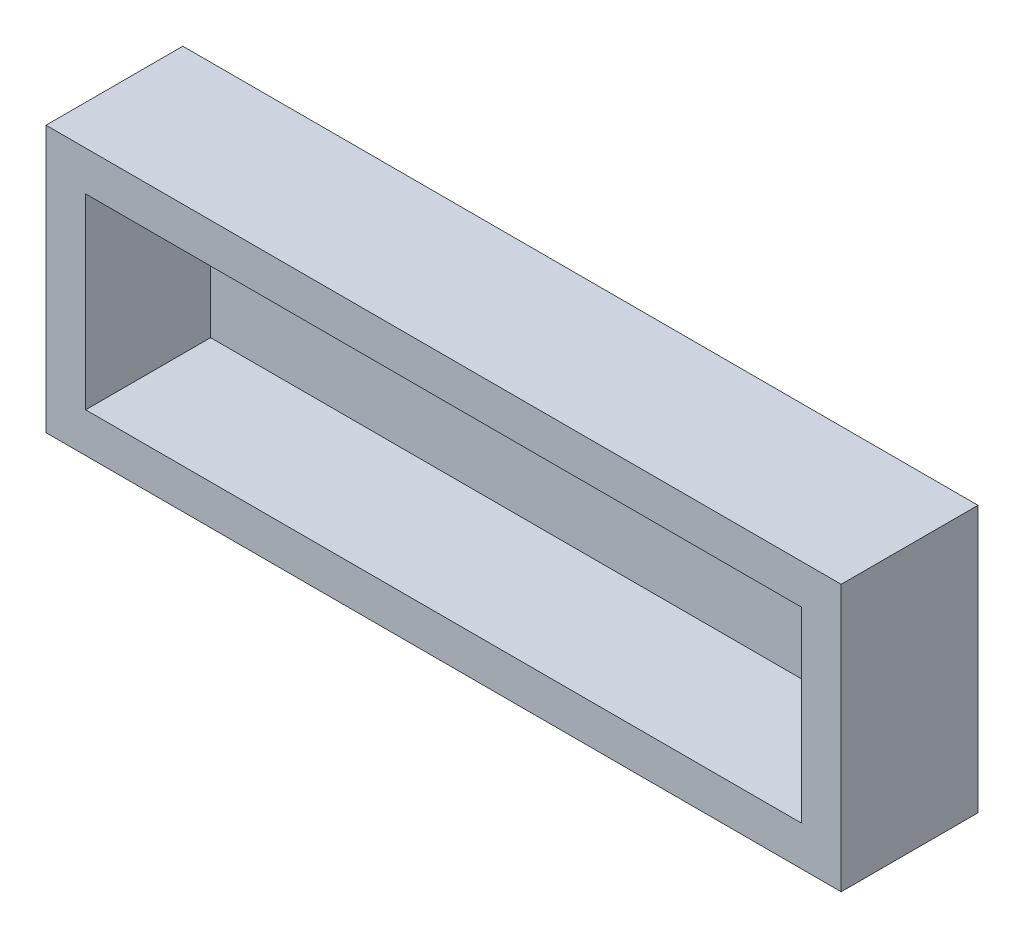
ISO-10303-21;
HEADER;
FILE_DESCRIPTION(('STEP AP214'),'2;1');
FILE_NAME('part.step','',(''),(''),'','','');
FILE_SCHEMA(('AUTOMOTIVE_DESIGN { 1 0 10303 214 1 1 1 1 }'));
ENDSEC;
DATA;
#1=APPLICATION_CONTEXT('core data for automotive mechanical design processes');
#2=APPLICATION_PROTOCOL_DEFINITION('international standard','automotive_design',2000,#1);
#3=PRODUCT_CONTEXT('',#1,'mechanical');
#4=PRODUCT('Part','Part','',(#3));
#5=PRODUCT_RELATED_PRODUCT_CATEGORY('part','',(#4));
#6=PRODUCT_DEFINITION_FORMATION('','',#4);
#7=PRODUCT_DEFINITION_CONTEXT('part definition',#1,'design');
#8=PRODUCT_DEFINITION('design','',#6,#7);
#9=PRODUCT_DEFINITION_SHAPE('','',#8);
#10=(LENGTH_UNIT() NAMED_UNIT(*) SI_UNIT(.MILLI.,.METRE.));
#11=(NAMED_UNIT(*) PLANE_ANGLE_UNIT() SI_UNIT($,.RADIAN.));
#12=(NAMED_UNIT(*) SI_UNIT($,.STERADIAN.) SOLID_ANGLE_UNIT());
#13=UNCERTAINTY_MEASURE_WITH_UNIT(LENGTH_MEASURE(1.E-05),#10,'distance_accuracy_value','');
#14=(GEOMETRIC_REPRESENTATION_CONTEXT(3) GLOBAL_UNCERTAINTY_ASSIGNED_CONTEXT((#13)) GLOBAL_UNIT_ASSIGNED_CONTEXT((#10,
#11,#12)) REPRESENTATION_CONTEXT('',''));
#15=CARTESIAN_POINT('',(0.,0.,0.));
#16=DIRECTION('',(0.,0.,1.));
#17=DIRECTION('',(1.,0.,0.));
#18=AXIS2_PLACEMENT_3D('',#15,#16,#17);
#19=CARTESIAN_POINT('',(-100.251,-33.576,34.5));
#20=DIRECTION('',(1.,0.,0.));
#21=DIRECTION('',(0.,0.,-1.));
#22=AXIS2_PLACEMENT_3D('',#19,#20,#21);
#23=PLANE('',#22);
#24=DIRECTION('',(0.,-1.,0.));
#25=VECTOR('',#24,1.);
#26=CARTESIAN_POINT('',(-100.251,-33.576,0.));
#27=LINE('',#26,#25);
#28=CARTESIAN_POINT('',(-100.251,33.576,0.));
#29=VERTEX_POINT('',#28);
#30=CARTESIAN_POINT('',(-100.251,-33.576,0.));
#31=VERTEX_POINT('',#30);
#32=EDGE_CURVE('E167',#29,#31,#27,.T.);
#33=ORIENTED_EDGE('',*,*,#32,.T.);
#34=DIRECTION('',(0.,0.,-1.));
#35=VECTOR('',#34,1.);
#36=CARTESIAN_POINT('',(-100.251,-33.576,34.5));
#37=LINE('',#36,#35);
#38=CARTESIAN_POINT('',(-100.251,-33.576,34.5));
#39=VERTEX_POINT('',#38);
#40=EDGE_CURVE('E11',#39,#31,#37,.T.);
#41=ORIENTED_EDGE('',*,*,#40,.F.);
#42=DIRECTION('',(0.,-1.,0.));
#43=VECTOR('',#42,1.);
#44=CARTESIAN_POINT('',(-100.251,-33.576,34.5));
#45=LINE('',#44,#43);
#46=CARTESIAN_POINT('',(-100.251,33.576,34.5));
#47=VERTEX_POINT('',#46);
#48=EDGE_CURVE('E156',#47,#39,#45,.T.);
#49=ORIENTED_EDGE('',*,*,#48,.F.);
#50=DIRECTION('',(0.,0.,-1.));
#51=VECTOR('',#50,1.);
#52=CARTESIAN_POINT('',(-100.251,33.576,34.5));
#53=LINE('',#52,#51);
#54=EDGE_CURVE('E166',#47,#29,#53,.T.);
#55=ORIENTED_EDGE('',*,*,#54,.T.);
#56=EDGE_LOOP('',(#33,#41,#49,#55));
#57=FACE_BOUND('',#56,.T.);
#58=ADVANCED_FACE('F39',(#57),#23,.F.);
#59=CARTESIAN_POINT('',(100.251,-33.576,34.5));
#60=DIRECTION('',(0.,1.,0.));
#61=DIRECTION('',(-1.,0.,0.));
#62=AXIS2_PLACEMENT_3D('',#59,#60,#61);
#63=PLANE('',#62);
#64=DIRECTION('',(1.,0.,0.));
#65=VECTOR('',#64,1.);
#66=CARTESIAN_POINT('',(100.251,-33.576,0.));
#67=LINE('',#66,#65);
#68=CARTESIAN_POINT('',(100.251,-33.576,0.));
#69=VERTEX_POINT('',#68);
#70=EDGE_CURVE('E171',#31,#69,#67,.T.);
#71=ORIENTED_EDGE('',*,*,#70,.T.);
#72=DIRECTION('',(0.,0.,-1.));
#73=VECTOR('',#72,1.);
#74=CARTESIAN_POINT('',(100.251,-33.576,34.5));
#75=LINE('',#74,#73);
#76=CARTESIAN_POINT('',(100.251,-33.576,34.5));
#77=VERTEX_POINT('',#76);
#78=EDGE_CURVE('E47',#77,#69,#75,.T.);
#79=ORIENTED_EDGE('',*,*,#78,.F.);
#80=DIRECTION('',(1.,0.,0.));
#81=VECTOR('',#80,1.);
#82=CARTESIAN_POINT('',(100.251,-33.576,34.5));
#83=LINE('',#82,#81);
#84=EDGE_CURVE('E91',#39,#77,#83,.T.);
#85=ORIENTED_EDGE('',*,*,#84,.F.);
#86=ORIENTED_EDGE('',*,*,#40,.T.);
#87=EDGE_LOOP('',(#71,#79,#85,#86));
#88=FACE_BOUND('',#87,.T.);
#89=ADVANCED_FACE('F206',(#88),#63,.F.);
#90=CARTESIAN_POINT('',(100.251,-33.576,34.5));
#91=DIRECTION('',(-1.,0.,0.));
#92=DIRECTION('',(0.,0.,1.));
#93=AXIS2_PLACEMENT_3D('',#90,#91,#92);
#94=PLANE('',#93);
#95=DIRECTION('',(0.,1.,0.));
#96=VECTOR('',#95,1.);
#97=CARTESIAN_POINT('',(100.251,-33.576,0.));
#98=LINE('',#97,#96);
#99=CARTESIAN_POINT('',(100.251,33.576,0.));
#100=VERTEX_POINT('',#99);
#101=EDGE_CURVE('E174',#69,#100,#98,.T.);
#102=ORIENTED_EDGE('',*,*,#101,.T.);
#103=DIRECTION('',(0.,0.,-1.));
#104=VECTOR('',#103,1.);
#105=CARTESIAN_POINT('',(100.251,33.576,34.5));
#106=LINE('',#105,#104);
#107=CARTESIAN_POINT('',(100.251,33.576,34.5));
#108=VERTEX_POINT('',#107);
#109=EDGE_CURVE('E181',#108,#100,#106,.T.);
#110=ORIENTED_EDGE('',*,*,#109,.F.);
#111=DIRECTION('',(0.,1.,0.));
#112=VECTOR('',#111,1.);
#113=CARTESIAN_POINT('',(100.251,-33.576,34.5));
#114=LINE('',#113,#112);
#115=EDGE_CURVE('E161',#77,#108,#114,.T.);
#116=ORIENTED_EDGE('',*,*,#115,.F.);
#117=ORIENTED_EDGE('',*,*,#78,.T.);
#118=EDGE_LOOP('',(#102,#110,#116,#117));
#119=FACE_BOUND('',#118,.T.);
#120=ADVANCED_FACE('F188',(#119),#94,.F.);
#121=CARTESIAN_POINT('',(100.251,33.576,34.5));
#122=DIRECTION('',(0.,-1.,0.));
#123=DIRECTION('',(1.,0.,0.));
#124=AXIS2_PLACEMENT_3D('',#121,#122,#123);
#125=PLANE('',#124);
#126=DIRECTION('',(-1.,0.,0.));
#127=VECTOR('',#126,1.);
#128=CARTESIAN_POINT('',(100.251,33.576,0.));
#129=LINE('',#128,#127);
#130=EDGE_CURVE('E84',#100,#29,#129,.T.);
#131=ORIENTED_EDGE('',*,*,#130,.T.);
#132=ORIENTED_EDGE('',*,*,#54,.F.);
#133=DIRECTION('',(-1.,0.,0.));
#134=VECTOR('',#133,1.);
#135=CARTESIAN_POINT('',(100.251,33.576,34.5));
#136=LINE('',#135,#134);
#137=EDGE_CURVE('E63',#108,#47,#136,.T.);
#138=ORIENTED_EDGE('',*,*,#137,.F.);
#139=ORIENTED_EDGE('',*,*,#109,.T.);
#140=EDGE_LOOP('',(#131,#132,#138,#139));
#141=FACE_BOUND('',#140,.T.);
#142=ADVANCED_FACE('F196',(#141),#125,.F.);
#143=CARTESIAN_POINT('',(0.,0.,34.5));
#144=DIRECTION('',(0.,0.,1.));
#145=DIRECTION('',(1.,0.,0.));
#146=AXIS2_PLACEMENT_3D('',#143,#144,#145);
#147=PLANE('',#146);
#148=DIRECTION('',(0.,-1.,0.));
#149=VECTOR('',#148,1.);
#150=CARTESIAN_POINT('',(-90.251,-33.576,34.5));
#151=LINE('',#150,#149);
#152=CARTESIAN_POINT('',(-90.251,23.576,34.5));
#153=VERTEX_POINT('',#152);
#154=CARTESIAN_POINT('',(-90.251,-23.576,34.5));
#155=VERTEX_POINT('',#154);
#156=EDGE_CURVE('E140',#153,#155,#151,.T.);
#157=ORIENTED_EDGE('',*,*,#156,.F.);
#158=DIRECTION('',(-1.,0.,0.));
#159=VECTOR('',#158,1.);
#160=CARTESIAN_POINT('',(100.251,23.576,34.5));
#161=LINE('',#160,#159);
#162=CARTESIAN_POINT('',(90.251,23.576,34.5));
#163=VERTEX_POINT('',#162);
#164=EDGE_CURVE('E153',#163,#153,#161,.T.);
#165=ORIENTED_EDGE('',*,*,#164,.F.);
#166=DIRECTION('',(0.,1.,0.));
#167=VECTOR('',#166,1.);
#168=CARTESIAN_POINT('',(90.251,-33.576,34.5));
#169=LINE('',#168,#167);
#170=CARTESIAN_POINT('',(90.251,-23.576,34.5));
#171=VERTEX_POINT('',#170);
#172=EDGE_CURVE('E150',#171,#163,#169,.T.);
#173=ORIENTED_EDGE('',*,*,#172,.F.);
#174=DIRECTION('',(1.,0.,0.));
#175=VECTOR('',#174,1.);
#176=CARTESIAN_POINT('',(100.251,-23.576,34.5));
#177=LINE('',#176,#175);
#178=EDGE_CURVE('E129',#155,#171,#177,.T.);
#179=ORIENTED_EDGE('',*,*,#178,.F.);
#180=EDGE_LOOP('',(#157,#165,#173,#179));
#181=FACE_BOUND('',#180,.T.);
#182=ORIENTED_EDGE('',*,*,#48,.T.);
#183=ORIENTED_EDGE('',*,*,#84,.T.);
#184=ORIENTED_EDGE('',*,*,#115,.T.);
#185=ORIENTED_EDGE('',*,*,#137,.T.);
#186=EDGE_LOOP('',(#182,#183,#184,#185));
#187=FACE_BOUND('',#186,.T.);
#188=ADVANCED_FACE('F198',(#181,#187),#147,.T.);
#189=CARTESIAN_POINT('',(0.,0.,0.));
#190=DIRECTION('',(0.,0.,1.));
#191=DIRECTION('',(1.,0.,0.));
#192=AXIS2_PLACEMENT_3D('',#189,#190,#191);
#193=PLANE('',#192);
#194=ORIENTED_EDGE('',*,*,#32,.F.);
#195=ORIENTED_EDGE('',*,*,#130,.F.);
#196=ORIENTED_EDGE('',*,*,#101,.F.);
#197=ORIENTED_EDGE('',*,*,#70,.F.);
#198=EDGE_LOOP('',(#194,#195,#196,#197));
#199=FACE_BOUND('',#198,.T.);
#200=ADVANCED_FACE('F192',(#199),#193,.F.);
#201=CARTESIAN_POINT('',(-90.251,-33.576,34.5));
#202=DIRECTION('',(1.,0.,0.));
#203=DIRECTION('',(0.,0.,-1.));
#204=AXIS2_PLACEMENT_3D('',#201,#202,#203);
#205=PLANE('',#204);
#206=DIRECTION('',(0.,-1.,0.));
#207=VECTOR('',#206,1.);
#208=CARTESIAN_POINT('',(-90.251,-33.576,3.));
#209=LINE('',#208,#207);
#210=CARTESIAN_POINT('',(-90.251,23.576,3.));
#211=VERTEX_POINT('',#210);
#212=CARTESIAN_POINT('',(-90.251,-23.576,3.));
#213=VERTEX_POINT('',#212);
#214=EDGE_CURVE('E119',#211,#213,#209,.T.);
#215=ORIENTED_EDGE('',*,*,#214,.F.);
#216=DIRECTION('',(0.,0.,-1.));
#217=VECTOR('',#216,1.);
#218=CARTESIAN_POINT('',(-90.251,23.576,34.5));
#219=LINE('',#218,#217);
#220=EDGE_CURVE('E144',#153,#211,#219,.T.);
#221=ORIENTED_EDGE('',*,*,#220,.F.);
#222=ORIENTED_EDGE('',*,*,#156,.T.);
#223=DIRECTION('',(0.,0.,-1.));
#224=VECTOR('',#223,1.);
#225=CARTESIAN_POINT('',(-90.251,-23.576,34.5));
#226=LINE('',#225,#224);
#227=EDGE_CURVE('E133',#155,#213,#226,.T.);
#228=ORIENTED_EDGE('',*,*,#227,.T.);
#229=EDGE_LOOP('',(#215,#221,#222,#228));
#230=FACE_BOUND('',#229,.T.);
#231=ADVANCED_FACE('F233',(#230),#205,.T.);
#232=CARTESIAN_POINT('',(100.251,-23.576,34.5));
#233=DIRECTION('',(0.,1.,0.));
#234=DIRECTION('',(-1.,0.,0.));
#235=AXIS2_PLACEMENT_3D('',#232,#233,#234);
#236=PLANE('',#235);
#237=DIRECTION('',(1.,0.,0.));
#238=VECTOR('',#237,1.);
#239=CARTESIAN_POINT('',(100.251,-23.576,3.));
#240=LINE('',#239,#238);
#241=CARTESIAN_POINT('',(90.251,-23.576,3.));
#242=VERTEX_POINT('',#241);
#243=EDGE_CURVE('E113',#213,#242,#240,.T.);
#244=ORIENTED_EDGE('',*,*,#243,.F.);
#245=ORIENTED_EDGE('',*,*,#227,.F.);
#246=ORIENTED_EDGE('',*,*,#178,.T.);
#247=DIRECTION('',(0.,0.,-1.));
#248=VECTOR('',#247,1.);
#249=CARTESIAN_POINT('',(90.251,-23.576,34.5));
#250=LINE('',#249,#248);
#251=EDGE_CURVE('E126',#171,#242,#250,.T.);
#252=ORIENTED_EDGE('',*,*,#251,.T.);
#253=EDGE_LOOP('',(#244,#245,#246,#252));
#254=FACE_BOUND('',#253,.T.);
#255=ADVANCED_FACE('F127',(#254),#236,.T.);
#256=CARTESIAN_POINT('',(90.251,-33.576,34.5));
#257=DIRECTION('',(-1.,0.,0.));
#258=DIRECTION('',(0.,0.,1.));
#259=AXIS2_PLACEMENT_3D('',#256,#257,#258);
#260=PLANE('',#259);
#261=DIRECTION('',(0.,1.,0.));
#262=VECTOR('',#261,1.);
#263=CARTESIAN_POINT('',(90.251,-33.576,3.));
#264=LINE('',#263,#262);
#265=CARTESIAN_POINT('',(90.251,23.576,3.));
#266=VERTEX_POINT('',#265);
#267=EDGE_CURVE('E117',#242,#266,#264,.T.);
#268=ORIENTED_EDGE('',*,*,#267,.F.);
#269=ORIENTED_EDGE('',*,*,#251,.F.);
#270=ORIENTED_EDGE('',*,*,#172,.T.);
#271=DIRECTION('',(0.,0.,-1.));
#272=VECTOR('',#271,1.);
#273=CARTESIAN_POINT('',(90.251,23.576,34.5));
#274=LINE('',#273,#272);
#275=EDGE_CURVE('E54',#163,#266,#274,.T.);
#276=ORIENTED_EDGE('',*,*,#275,.T.);
#277=EDGE_LOOP('',(#268,#269,#270,#276));
#278=FACE_BOUND('',#277,.T.);
#279=ADVANCED_FACE('F135',(#278),#260,.T.);
#280=CARTESIAN_POINT('',(100.251,23.576,34.5));
#281=DIRECTION('',(0.,-1.,0.));
#282=DIRECTION('',(1.,0.,0.));
#283=AXIS2_PLACEMENT_3D('',#280,#281,#282);
#284=PLANE('',#283);
#285=DIRECTION('',(-1.,0.,0.));
#286=VECTOR('',#285,1.);
#287=CARTESIAN_POINT('',(100.251,23.576,3.));
#288=LINE('',#287,#286);
#289=EDGE_CURVE('E137',#266,#211,#288,.T.);
#290=ORIENTED_EDGE('',*,*,#289,.F.);
#291=ORIENTED_EDGE('',*,*,#275,.F.);
#292=ORIENTED_EDGE('',*,*,#164,.T.);
#293=ORIENTED_EDGE('',*,*,#220,.T.);
#294=EDGE_LOOP('',(#290,#291,#292,#293));
#295=FACE_BOUND('',#294,.T.);
#296=ADVANCED_FACE('F263',(#295),#284,.T.);
#297=CARTESIAN_POINT('',(0.,0.,3.));
#298=DIRECTION('',(0.,0.,1.));
#299=DIRECTION('',(1.,0.,0.));
#300=AXIS2_PLACEMENT_3D('',#297,#298,#299);
#301=PLANE('',#300);
#302=ORIENTED_EDGE('',*,*,#214,.T.);
#303=ORIENTED_EDGE('',*,*,#243,.T.);
#304=ORIENTED_EDGE('',*,*,#267,.T.);
#305=ORIENTED_EDGE('',*,*,#289,.T.);
#306=EDGE_LOOP('',(#302,#303,#304,#305));
#307=FACE_BOUND('',#306,.T.);
#308=ADVANCED_FACE('F115',(#307),#301,.T.);
#309=CLOSED_SHELL('',(#58,#89,#120,#142,#188,#200,#231,#255,#279,#296,#308));
#310=MANIFOLD_SOLID_BREP('B2',#309);
#311=ADVANCED_BREP_SHAPE_REPRESENTATION('',(#18,#310),#14);
#312=SHAPE_DEFINITION_REPRESENTATION(#9,#311);
ENDSEC;
END-ISO-10303-21;
